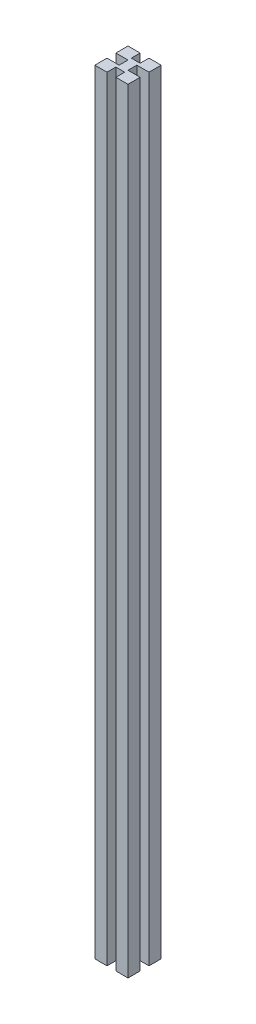
ISO-10303-21;
HEADER;
FILE_DESCRIPTION(('STEP AP214'),'2;1');
FILE_NAME('part.step','',(''),(''),'','','');
FILE_SCHEMA(('AUTOMOTIVE_DESIGN { 1 0 10303 214 1 1 1 1 }'));
ENDSEC;
DATA;
#1=APPLICATION_CONTEXT('core data for automotive mechanical design processes');
#2=APPLICATION_PROTOCOL_DEFINITION('international standard','automotive_design',2000,#1);
#3=PRODUCT_CONTEXT('',#1,'mechanical');
#4=PRODUCT('Part','Part','',(#3));
#5=PRODUCT_RELATED_PRODUCT_CATEGORY('part','',(#4));
#6=PRODUCT_DEFINITION_FORMATION('','',#4);
#7=PRODUCT_DEFINITION_CONTEXT('part definition',#1,'design');
#8=PRODUCT_DEFINITION('design','',#6,#7);
#9=PRODUCT_DEFINITION_SHAPE('','',#8);
#10=(LENGTH_UNIT() NAMED_UNIT(*) SI_UNIT(.MILLI.,.METRE.));
#11=(NAMED_UNIT(*) PLANE_ANGLE_UNIT() SI_UNIT($,.RADIAN.));
#12=(NAMED_UNIT(*) SI_UNIT($,.STERADIAN.) SOLID_ANGLE_UNIT());
#13=UNCERTAINTY_MEASURE_WITH_UNIT(LENGTH_MEASURE(1.E-05),#10,'distance_accuracy_value','');
#14=(GEOMETRIC_REPRESENTATION_CONTEXT(3) GLOBAL_UNCERTAINTY_ASSIGNED_CONTEXT((#13)) GLOBAL_UNIT_ASSIGNED_CONTEXT((#10,
#11,#12)) REPRESENTATION_CONTEXT('',''));
#15=CARTESIAN_POINT('',(0.,0.,0.));
#16=DIRECTION('',(0.,0.,1.));
#17=DIRECTION('',(1.,0.,0.));
#18=AXIS2_PLACEMENT_3D('',#15,#16,#17);
#19=CARTESIAN_POINT('',(-11.,700.,0.));
#20=DIRECTION('',(1.,0.,0.));
#21=DIRECTION('',(0.,0.,-1.));
#22=AXIS2_PLACEMENT_3D('',#19,#20,#21);
#23=PLANE('',#22);
#24=DIRECTION('',(0.,0.,1.));
#25=VECTOR('',#24,1.);
#26=CARTESIAN_POINT('',(-11.,0.,0.));
#27=LINE('',#26,#25);
#28=CARTESIAN_POINT('',(-11.,0.,-3.));
#29=VERTEX_POINT('',#28);
#30=CARTESIAN_POINT('',(-11.,0.,8.));
#31=VERTEX_POINT('',#30);
#32=EDGE_CURVE('E214',#29,#31,#27,.T.);
#33=ORIENTED_EDGE('',*,*,#32,.T.);
#34=DIRECTION('',(0.,-1.,0.));
#35=VECTOR('',#34,1.);
#36=CARTESIAN_POINT('',(-11.,700.,8.));
#37=LINE('',#36,#35);
#38=CARTESIAN_POINT('',(-11.,700.,8.));
#39=VERTEX_POINT('',#38);
#40=EDGE_CURVE('E11',#39,#31,#37,.T.);
#41=ORIENTED_EDGE('',*,*,#40,.F.);
#42=DIRECTION('',(0.,0.,1.));
#43=VECTOR('',#42,1.);
#44=CARTESIAN_POINT('',(-11.,700.,0.));
#45=LINE('',#44,#43);
#46=CARTESIAN_POINT('',(-11.,700.,-3.));
#47=VERTEX_POINT('',#46);
#48=EDGE_CURVE('E274',#47,#39,#45,.T.);
#49=ORIENTED_EDGE('',*,*,#48,.F.);
#50=DIRECTION('',(0.,-1.,0.));
#51=VECTOR('',#50,1.);
#52=CARTESIAN_POINT('',(-11.,700.,-3.));
#53=LINE('',#52,#51);
#54=EDGE_CURVE('E210',#47,#29,#53,.T.);
#55=ORIENTED_EDGE('',*,*,#54,.T.);
#56=EDGE_LOOP('',(#33,#41,#49,#55));
#57=FACE_BOUND('',#56,.T.);
#58=ADVANCED_FACE('F41',(#57),#23,.F.);
#59=CARTESIAN_POINT('',(0.,700.,8.));
#60=DIRECTION('',(0.,0.,-1.));
#61=DIRECTION('',(-1.,0.,0.));
#62=AXIS2_PLACEMENT_3D('',#59,#60,#61);
#63=PLANE('',#62);
#64=DIRECTION('',(1.,0.,0.));
#65=VECTOR('',#64,1.);
#66=CARTESIAN_POINT('',(0.,0.,8.));
#67=LINE('',#66,#65);
#68=CARTESIAN_POINT('',(0.,0.,8.));
#69=VERTEX_POINT('',#68);
#70=EDGE_CURVE('E218',#31,#69,#67,.T.);
#71=ORIENTED_EDGE('',*,*,#70,.T.);
#72=DIRECTION('',(0.,-1.,0.));
#73=VECTOR('',#72,1.);
#74=CARTESIAN_POINT('',(0.,700.,8.));
#75=LINE('',#74,#73);
#76=CARTESIAN_POINT('',(0.,700.,8.));
#77=VERTEX_POINT('',#76);
#78=EDGE_CURVE('E50',#77,#69,#75,.T.);
#79=ORIENTED_EDGE('',*,*,#78,.F.);
#80=DIRECTION('',(1.,0.,0.));
#81=VECTOR('',#80,1.);
#82=CARTESIAN_POINT('',(0.,700.,8.));
#83=LINE('',#82,#81);
#84=EDGE_CURVE('E137',#39,#77,#83,.T.);
#85=ORIENTED_EDGE('',*,*,#84,.F.);
#86=ORIENTED_EDGE('',*,*,#40,.T.);
#87=EDGE_LOOP('',(#71,#79,#85,#86));
#88=FACE_BOUND('',#87,.T.);
#89=ADVANCED_FACE('F342',(#88),#63,.F.);
#90=CARTESIAN_POINT('',(0.,700.,0.));
#91=DIRECTION('',(1.,0.,0.));
#92=DIRECTION('',(0.,0.,-1.));
#93=AXIS2_PLACEMENT_3D('',#90,#91,#92);
#94=PLANE('',#93);
#95=DIRECTION('',(0.,0.,1.));
#96=VECTOR('',#95,1.);
#97=CARTESIAN_POINT('',(0.,0.,0.));
#98=LINE('',#97,#96);
#99=CARTESIAN_POINT('',(0.,0.,0.));
#100=VERTEX_POINT('',#99);
#101=EDGE_CURVE('E222',#100,#69,#98,.T.);
#102=ORIENTED_EDGE('',*,*,#101,.F.);
#103=DIRECTION('',(0.,-1.,0.));
#104=VECTOR('',#103,1.);
#105=CARTESIAN_POINT('',(0.,700.,0.));
#106=LINE('',#105,#104);
#107=CARTESIAN_POINT('',(0.,700.,0.));
#108=VERTEX_POINT('',#107);
#109=EDGE_CURVE('E333',#108,#100,#106,.T.);
#110=ORIENTED_EDGE('',*,*,#109,.F.);
#111=DIRECTION('',(0.,0.,1.));
#112=VECTOR('',#111,1.);
#113=CARTESIAN_POINT('',(0.,700.,0.));
#114=LINE('',#113,#112);
#115=EDGE_CURVE('E341',#108,#77,#114,.T.);
#116=ORIENTED_EDGE('',*,*,#115,.T.);
#117=ORIENTED_EDGE('',*,*,#78,.T.);
#118=EDGE_LOOP('',(#102,#110,#116,#117));
#119=FACE_BOUND('',#118,.T.);
#120=ADVANCED_FACE('F339',(#119),#94,.T.);
#121=CARTESIAN_POINT('',(0.,700.,0.));
#122=DIRECTION('',(0.,0.,-1.));
#123=DIRECTION('',(-1.,0.,0.));
#124=AXIS2_PLACEMENT_3D('',#121,#122,#123);
#125=PLANE('',#124);
#126=DIRECTION('',(1.,0.,0.));
#127=VECTOR('',#126,1.);
#128=CARTESIAN_POINT('',(0.,0.,0.));
#129=LINE('',#128,#127);
#130=CARTESIAN_POINT('',(8.,0.,0.));
#131=VERTEX_POINT('',#130);
#132=EDGE_CURVE('E226',#100,#131,#129,.T.);
#133=ORIENTED_EDGE('',*,*,#132,.T.);
#134=DIRECTION('',(0.,-1.,0.));
#135=VECTOR('',#134,1.);
#136=CARTESIAN_POINT('',(8.,700.,0.));
#137=LINE('',#136,#135);
#138=CARTESIAN_POINT('',(8.,700.,0.));
#139=VERTEX_POINT('',#138);
#140=EDGE_CURVE('E329',#139,#131,#137,.T.);
#141=ORIENTED_EDGE('',*,*,#140,.F.);
#142=DIRECTION('',(1.,0.,0.));
#143=VECTOR('',#142,1.);
#144=CARTESIAN_POINT('',(0.,700.,0.));
#145=LINE('',#144,#143);
#146=EDGE_CURVE('E362',#108,#139,#145,.T.);
#147=ORIENTED_EDGE('',*,*,#146,.F.);
#148=ORIENTED_EDGE('',*,*,#109,.T.);
#149=EDGE_LOOP('',(#133,#141,#147,#148));
#150=FACE_BOUND('',#149,.T.);
#151=ADVANCED_FACE('F352',(#150),#125,.F.);
#152=CARTESIAN_POINT('',(8.,700.,0.));
#153=DIRECTION('',(1.,0.,0.));
#154=DIRECTION('',(0.,0.,-1.));
#155=AXIS2_PLACEMENT_3D('',#152,#153,#154);
#156=PLANE('',#155);
#157=DIRECTION('',(0.,0.,1.));
#158=VECTOR('',#157,1.);
#159=CARTESIAN_POINT('',(8.,0.,0.));
#160=LINE('',#159,#158);
#161=CARTESIAN_POINT('',(8.,0.,8.));
#162=VERTEX_POINT('',#161);
#163=EDGE_CURVE('E229',#131,#162,#160,.T.);
#164=ORIENTED_EDGE('',*,*,#163,.T.);
#165=DIRECTION('',(0.,-1.,0.));
#166=VECTOR('',#165,1.);
#167=CARTESIAN_POINT('',(8.,700.,8.));
#168=LINE('',#167,#166);
#169=CARTESIAN_POINT('',(8.,700.,8.));
#170=VERTEX_POINT('',#169);
#171=EDGE_CURVE('E325',#170,#162,#168,.T.);
#172=ORIENTED_EDGE('',*,*,#171,.F.);
#173=DIRECTION('',(0.,0.,1.));
#174=VECTOR('',#173,1.);
#175=CARTESIAN_POINT('',(8.,700.,0.));
#176=LINE('',#175,#174);
#177=EDGE_CURVE('E358',#139,#170,#176,.T.);
#178=ORIENTED_EDGE('',*,*,#177,.F.);
#179=ORIENTED_EDGE('',*,*,#140,.T.);
#180=EDGE_LOOP('',(#164,#172,#178,#179));
#181=FACE_BOUND('',#180,.T.);
#182=ADVANCED_FACE('F356',(#181),#156,.F.);
#183=CARTESIAN_POINT('',(0.,700.,8.));
#184=DIRECTION('',(0.,0.,-1.));
#185=DIRECTION('',(-1.,0.,0.));
#186=AXIS2_PLACEMENT_3D('',#183,#184,#185);
#187=PLANE('',#186);
#188=DIRECTION('',(1.,0.,0.));
#189=VECTOR('',#188,1.);
#190=CARTESIAN_POINT('',(0.,0.,8.));
#191=LINE('',#190,#189);
#192=CARTESIAN_POINT('',(19.,0.,8.));
#193=VERTEX_POINT('',#192);
#194=EDGE_CURVE('E232',#162,#193,#191,.T.);
#195=ORIENTED_EDGE('',*,*,#194,.T.);
#196=DIRECTION('',(0.,-1.,0.));
#197=VECTOR('',#196,1.);
#198=CARTESIAN_POINT('',(19.,700.,8.));
#199=LINE('',#198,#197);
#200=CARTESIAN_POINT('',(19.,700.,8.));
#201=VERTEX_POINT('',#200);
#202=EDGE_CURVE('E321',#201,#193,#199,.T.);
#203=ORIENTED_EDGE('',*,*,#202,.F.);
#204=DIRECTION('',(1.,0.,0.));
#205=VECTOR('',#204,1.);
#206=CARTESIAN_POINT('',(0.,700.,8.));
#207=LINE('',#206,#205);
#208=EDGE_CURVE('E361',#170,#201,#207,.T.);
#209=ORIENTED_EDGE('',*,*,#208,.F.);
#210=ORIENTED_EDGE('',*,*,#171,.T.);
#211=EDGE_LOOP('',(#195,#203,#209,#210));
#212=FACE_BOUND('',#211,.T.);
#213=ADVANCED_FACE('F435',(#212),#187,.F.);
#214=CARTESIAN_POINT('',(19.,700.,0.));
#215=DIRECTION('',(-1.,0.,0.));
#216=DIRECTION('',(0.,0.,1.));
#217=AXIS2_PLACEMENT_3D('',#214,#215,#216);
#218=PLANE('',#217);
#219=DIRECTION('',(0.,0.,-1.));
#220=VECTOR('',#219,1.);
#221=CARTESIAN_POINT('',(19.,0.,0.));
#222=LINE('',#221,#220);
#223=CARTESIAN_POINT('',(19.,0.,-3.));
#224=VERTEX_POINT('',#223);
#225=EDGE_CURVE('E235',#193,#224,#222,.T.);
#226=ORIENTED_EDGE('',*,*,#225,.T.);
#227=DIRECTION('',(0.,-1.,0.));
#228=VECTOR('',#227,1.);
#229=CARTESIAN_POINT('',(19.,700.,-3.));
#230=LINE('',#229,#228);
#231=CARTESIAN_POINT('',(19.,700.,-3.));
#232=VERTEX_POINT('',#231);
#233=EDGE_CURVE('E317',#232,#224,#230,.T.);
#234=ORIENTED_EDGE('',*,*,#233,.F.);
#235=DIRECTION('',(0.,0.,-1.));
#236=VECTOR('',#235,1.);
#237=CARTESIAN_POINT('',(19.,700.,0.));
#238=LINE('',#237,#236);
#239=EDGE_CURVE('E366',#201,#232,#238,.T.);
#240=ORIENTED_EDGE('',*,*,#239,.F.);
#241=ORIENTED_EDGE('',*,*,#202,.T.);
#242=EDGE_LOOP('',(#226,#234,#240,#241));
#243=FACE_BOUND('',#242,.T.);
#244=ADVANCED_FACE('F438',(#243),#218,.F.);
#245=CARTESIAN_POINT('',(0.,700.,-3.));
#246=DIRECTION('',(0.,0.,1.));
#247=DIRECTION('',(1.,0.,0.));
#248=AXIS2_PLACEMENT_3D('',#245,#246,#247);
#249=PLANE('',#248);
#250=DIRECTION('',(-1.,0.,0.));
#251=VECTOR('',#250,1.);
#252=CARTESIAN_POINT('',(0.,0.,-3.));
#253=LINE('',#252,#251);
#254=CARTESIAN_POINT('',(8.,0.,-3.));
#255=VERTEX_POINT('',#254);
#256=EDGE_CURVE('E238',#224,#255,#253,.T.);
#257=ORIENTED_EDGE('',*,*,#256,.T.);
#258=DIRECTION('',(0.,-1.,0.));
#259=VECTOR('',#258,1.);
#260=CARTESIAN_POINT('',(8.,700.,-3.));
#261=LINE('',#260,#259);
#262=CARTESIAN_POINT('',(8.,700.,-3.));
#263=VERTEX_POINT('',#262);
#264=EDGE_CURVE('E313',#263,#255,#261,.T.);
#265=ORIENTED_EDGE('',*,*,#264,.F.);
#266=DIRECTION('',(-1.,0.,0.));
#267=VECTOR('',#266,1.);
#268=CARTESIAN_POINT('',(0.,700.,-3.));
#269=LINE('',#268,#267);
#270=EDGE_CURVE('E373',#232,#263,#269,.T.);
#271=ORIENTED_EDGE('',*,*,#270,.F.);
#272=ORIENTED_EDGE('',*,*,#233,.T.);
#273=EDGE_LOOP('',(#257,#265,#271,#272));
#274=FACE_BOUND('',#273,.T.);
#275=ADVANCED_FACE('F442',(#274),#249,.F.);
#276=CARTESIAN_POINT('',(8.,700.,0.));
#277=DIRECTION('',(-1.,0.,0.));
#278=DIRECTION('',(0.,0.,1.));
#279=AXIS2_PLACEMENT_3D('',#276,#277,#278);
#280=PLANE('',#279);
#281=DIRECTION('',(0.,0.,-1.));
#282=VECTOR('',#281,1.);
#283=CARTESIAN_POINT('',(8.,0.,0.));
#284=LINE('',#283,#282);
#285=CARTESIAN_POINT('',(8.,0.,-11.));
#286=VERTEX_POINT('',#285);
#287=EDGE_CURVE('E241',#255,#286,#284,.T.);
#288=ORIENTED_EDGE('',*,*,#287,.T.);
#289=DIRECTION('',(0.,-1.,0.));
#290=VECTOR('',#289,1.);
#291=CARTESIAN_POINT('',(8.,700.,-11.));
#292=LINE('',#291,#290);
#293=CARTESIAN_POINT('',(8.,700.,-11.));
#294=VERTEX_POINT('',#293);
#295=EDGE_CURVE('E309',#294,#286,#292,.T.);
#296=ORIENTED_EDGE('',*,*,#295,.F.);
#297=DIRECTION('',(0.,0.,-1.));
#298=VECTOR('',#297,1.);
#299=CARTESIAN_POINT('',(8.,700.,0.));
#300=LINE('',#299,#298);
#301=EDGE_CURVE('E376',#263,#294,#300,.T.);
#302=ORIENTED_EDGE('',*,*,#301,.F.);
#303=ORIENTED_EDGE('',*,*,#264,.T.);
#304=EDGE_LOOP('',(#288,#296,#302,#303));
#305=FACE_BOUND('',#304,.T.);
#306=ADVANCED_FACE('F446',(#305),#280,.F.);
#307=CARTESIAN_POINT('',(0.,700.,-11.));
#308=DIRECTION('',(0.,0.,-1.));
#309=DIRECTION('',(-1.,0.,0.));
#310=AXIS2_PLACEMENT_3D('',#307,#308,#309);
#311=PLANE('',#310);
#312=DIRECTION('',(1.,0.,0.));
#313=VECTOR('',#312,1.);
#314=CARTESIAN_POINT('',(0.,0.,-11.));
#315=LINE('',#314,#313);
#316=CARTESIAN_POINT('',(19.,0.,-11.));
#317=VERTEX_POINT('',#316);
#318=EDGE_CURVE('E244',#286,#317,#315,.T.);
#319=ORIENTED_EDGE('',*,*,#318,.T.);
#320=DIRECTION('',(0.,-1.,0.));
#321=VECTOR('',#320,1.);
#322=CARTESIAN_POINT('',(19.,700.,-11.));
#323=LINE('',#322,#321);
#324=CARTESIAN_POINT('',(19.,700.,-11.));
#325=VERTEX_POINT('',#324);
#326=EDGE_CURVE('E305',#325,#317,#323,.T.);
#327=ORIENTED_EDGE('',*,*,#326,.F.);
#328=DIRECTION('',(1.,0.,0.));
#329=VECTOR('',#328,1.);
#330=CARTESIAN_POINT('',(0.,700.,-11.));
#331=LINE('',#330,#329);
#332=EDGE_CURVE('E379',#294,#325,#331,.T.);
#333=ORIENTED_EDGE('',*,*,#332,.F.);
#334=ORIENTED_EDGE('',*,*,#295,.T.);
#335=EDGE_LOOP('',(#319,#327,#333,#334));
#336=FACE_BOUND('',#335,.T.);
#337=ADVANCED_FACE('F450',(#336),#311,.F.);
#338=CARTESIAN_POINT('',(19.,700.,0.));
#339=DIRECTION('',(-1.,0.,0.));
#340=DIRECTION('',(0.,0.,1.));
#341=AXIS2_PLACEMENT_3D('',#338,#339,#340);
#342=PLANE('',#341);
#343=DIRECTION('',(0.,0.,-1.));
#344=VECTOR('',#343,1.);
#345=CARTESIAN_POINT('',(19.,0.,0.));
#346=LINE('',#345,#344);
#347=CARTESIAN_POINT('',(19.,0.,-22.));
#348=VERTEX_POINT('',#347);
#349=EDGE_CURVE('E247',#317,#348,#346,.T.);
#350=ORIENTED_EDGE('',*,*,#349,.T.);
#351=DIRECTION('',(0.,-1.,0.));
#352=VECTOR('',#351,1.);
#353=CARTESIAN_POINT('',(19.,700.,-22.));
#354=LINE('',#353,#352);
#355=CARTESIAN_POINT('',(19.,700.,-22.));
#356=VERTEX_POINT('',#355);
#357=EDGE_CURVE('E301',#356,#348,#354,.T.);
#358=ORIENTED_EDGE('',*,*,#357,.F.);
#359=DIRECTION('',(0.,0.,-1.));
#360=VECTOR('',#359,1.);
#361=CARTESIAN_POINT('',(19.,700.,0.));
#362=LINE('',#361,#360);
#363=EDGE_CURVE('E382',#325,#356,#362,.T.);
#364=ORIENTED_EDGE('',*,*,#363,.F.);
#365=ORIENTED_EDGE('',*,*,#326,.T.);
#366=EDGE_LOOP('',(#350,#358,#364,#365));
#367=FACE_BOUND('',#366,.T.);
#368=ADVANCED_FACE('F454',(#367),#342,.F.);
#369=CARTESIAN_POINT('',(0.,700.,-22.));
#370=DIRECTION('',(0.,0.,1.));
#371=DIRECTION('',(1.,0.,0.));
#372=AXIS2_PLACEMENT_3D('',#369,#370,#371);
#373=PLANE('',#372);
#374=DIRECTION('',(-1.,0.,0.));
#375=VECTOR('',#374,1.);
#376=CARTESIAN_POINT('',(0.,0.,-22.));
#377=LINE('',#376,#375);
#378=CARTESIAN_POINT('',(8.,0.,-22.));
#379=VERTEX_POINT('',#378);
#380=EDGE_CURVE('E250',#348,#379,#377,.T.);
#381=ORIENTED_EDGE('',*,*,#380,.T.);
#382=DIRECTION('',(0.,-1.,0.));
#383=VECTOR('',#382,1.);
#384=CARTESIAN_POINT('',(8.,700.,-22.));
#385=LINE('',#384,#383);
#386=CARTESIAN_POINT('',(8.,700.,-22.));
#387=VERTEX_POINT('',#386);
#388=EDGE_CURVE('E297',#387,#379,#385,.T.);
#389=ORIENTED_EDGE('',*,*,#388,.F.);
#390=DIRECTION('',(-1.,0.,0.));
#391=VECTOR('',#390,1.);
#392=CARTESIAN_POINT('',(0.,700.,-22.));
#393=LINE('',#392,#391);
#394=EDGE_CURVE('E385',#356,#387,#393,.T.);
#395=ORIENTED_EDGE('',*,*,#394,.F.);
#396=ORIENTED_EDGE('',*,*,#357,.T.);
#397=EDGE_LOOP('',(#381,#389,#395,#396));
#398=FACE_BOUND('',#397,.T.);
#399=ADVANCED_FACE('F458',(#398),#373,.F.);
#400=CARTESIAN_POINT('',(8.,700.,0.));
#401=DIRECTION('',(1.,0.,0.));
#402=DIRECTION('',(0.,0.,-1.));
#403=AXIS2_PLACEMENT_3D('',#400,#401,#402);
#404=PLANE('',#403);
#405=DIRECTION('',(0.,0.,1.));
#406=VECTOR('',#405,1.);
#407=CARTESIAN_POINT('',(8.,0.,0.));
#408=LINE('',#407,#406);
#409=CARTESIAN_POINT('',(8.,0.,-14.));
#410=VERTEX_POINT('',#409);
#411=EDGE_CURVE('E253',#379,#410,#408,.T.);
#412=ORIENTED_EDGE('',*,*,#411,.T.);
#413=DIRECTION('',(0.,-1.,0.));
#414=VECTOR('',#413,1.);
#415=CARTESIAN_POINT('',(8.,700.,-14.));
#416=LINE('',#415,#414);
#417=CARTESIAN_POINT('',(8.,700.,-14.));
#418=VERTEX_POINT('',#417);
#419=EDGE_CURVE('E293',#418,#410,#416,.T.);
#420=ORIENTED_EDGE('',*,*,#419,.F.);
#421=DIRECTION('',(0.,0.,1.));
#422=VECTOR('',#421,1.);
#423=CARTESIAN_POINT('',(8.,700.,0.));
#424=LINE('',#423,#422);
#425=EDGE_CURVE('E388',#387,#418,#424,.T.);
#426=ORIENTED_EDGE('',*,*,#425,.F.);
#427=ORIENTED_EDGE('',*,*,#388,.T.);
#428=EDGE_LOOP('',(#412,#420,#426,#427));
#429=FACE_BOUND('',#428,.T.);
#430=ADVANCED_FACE('F462',(#429),#404,.F.);
#431=CARTESIAN_POINT('',(0.,700.,-14.));
#432=DIRECTION('',(0.,0.,1.));
#433=DIRECTION('',(1.,0.,0.));
#434=AXIS2_PLACEMENT_3D('',#431,#432,#433);
#435=PLANE('',#434);
#436=DIRECTION('',(-1.,0.,0.));
#437=VECTOR('',#436,1.);
#438=CARTESIAN_POINT('',(0.,0.,-14.));
#439=LINE('',#438,#437);
#440=CARTESIAN_POINT('',(0.,0.,-14.));
#441=VERTEX_POINT('',#440);
#442=EDGE_CURVE('E256',#410,#441,#439,.T.);
#443=ORIENTED_EDGE('',*,*,#442,.T.);
#444=DIRECTION('',(0.,-1.,0.));
#445=VECTOR('',#444,1.);
#446=CARTESIAN_POINT('',(0.,700.,-14.));
#447=LINE('',#446,#445);
#448=CARTESIAN_POINT('',(0.,700.,-14.));
#449=VERTEX_POINT('',#448);
#450=EDGE_CURVE('E289',#449,#441,#447,.T.);
#451=ORIENTED_EDGE('',*,*,#450,.F.);
#452=DIRECTION('',(-1.,0.,0.));
#453=VECTOR('',#452,1.);
#454=CARTESIAN_POINT('',(0.,700.,-14.));
#455=LINE('',#454,#453);
#456=EDGE_CURVE('E391',#418,#449,#455,.T.);
#457=ORIENTED_EDGE('',*,*,#456,.F.);
#458=ORIENTED_EDGE('',*,*,#419,.T.);
#459=EDGE_LOOP('',(#443,#451,#457,#458));
#460=FACE_BOUND('',#459,.T.);
#461=ADVANCED_FACE('F466',(#460),#435,.F.);
#462=CARTESIAN_POINT('',(0.,700.,0.));
#463=DIRECTION('',(-1.,0.,0.));
#464=DIRECTION('',(0.,0.,1.));
#465=AXIS2_PLACEMENT_3D('',#462,#463,#464);
#466=PLANE('',#465);
#467=DIRECTION('',(0.,0.,-1.));
#468=VECTOR('',#467,1.);
#469=CARTESIAN_POINT('',(0.,0.,0.));
#470=LINE('',#469,#468);
#471=CARTESIAN_POINT('',(0.,0.,-22.));
#472=VERTEX_POINT('',#471);
#473=EDGE_CURVE('E259',#441,#472,#470,.T.);
#474=ORIENTED_EDGE('',*,*,#473,.T.);
#475=DIRECTION('',(0.,-1.,0.));
#476=VECTOR('',#475,1.);
#477=CARTESIAN_POINT('',(0.,700.,-22.));
#478=LINE('',#477,#476);
#479=CARTESIAN_POINT('',(0.,700.,-22.));
#480=VERTEX_POINT('',#479);
#481=EDGE_CURVE('E285',#480,#472,#478,.T.);
#482=ORIENTED_EDGE('',*,*,#481,.F.);
#483=DIRECTION('',(0.,0.,-1.));
#484=VECTOR('',#483,1.);
#485=CARTESIAN_POINT('',(0.,700.,0.));
#486=LINE('',#485,#484);
#487=EDGE_CURVE('E394',#449,#480,#486,.T.);
#488=ORIENTED_EDGE('',*,*,#487,.F.);
#489=ORIENTED_EDGE('',*,*,#450,.T.);
#490=EDGE_LOOP('',(#474,#482,#488,#489));
#491=FACE_BOUND('',#490,.T.);
#492=ADVANCED_FACE('F470',(#491),#466,.F.);
#493=CARTESIAN_POINT('',(0.,700.,-22.));
#494=DIRECTION('',(0.,0.,1.));
#495=DIRECTION('',(1.,0.,0.));
#496=AXIS2_PLACEMENT_3D('',#493,#494,#495);
#497=PLANE('',#496);
#498=DIRECTION('',(-1.,0.,0.));
#499=VECTOR('',#498,1.);
#500=CARTESIAN_POINT('',(0.,0.,-22.));
#501=LINE('',#500,#499);
#502=CARTESIAN_POINT('',(-11.,0.,-22.));
#503=VERTEX_POINT('',#502);
#504=EDGE_CURVE('E262',#472,#503,#501,.T.);
#505=ORIENTED_EDGE('',*,*,#504,.T.);
#506=DIRECTION('',(0.,-1.,0.));
#507=VECTOR('',#506,1.);
#508=CARTESIAN_POINT('',(-11.,700.,-22.));
#509=LINE('',#508,#507);
#510=CARTESIAN_POINT('',(-11.,700.,-22.));
#511=VERTEX_POINT('',#510);
#512=EDGE_CURVE('E281',#511,#503,#509,.T.);
#513=ORIENTED_EDGE('',*,*,#512,.F.);
#514=DIRECTION('',(-1.,0.,0.));
#515=VECTOR('',#514,1.);
#516=CARTESIAN_POINT('',(0.,700.,-22.));
#517=LINE('',#516,#515);
#518=EDGE_CURVE('E397',#480,#511,#517,.T.);
#519=ORIENTED_EDGE('',*,*,#518,.F.);
#520=ORIENTED_EDGE('',*,*,#481,.T.);
#521=EDGE_LOOP('',(#505,#513,#519,#520));
#522=FACE_BOUND('',#521,.T.);
#523=ADVANCED_FACE('F405',(#522),#497,.F.);
#524=CARTESIAN_POINT('',(-11.,700.,0.));
#525=DIRECTION('',(1.,0.,0.));
#526=DIRECTION('',(0.,0.,-1.));
#527=AXIS2_PLACEMENT_3D('',#524,#525,#526);
#528=PLANE('',#527);
#529=DIRECTION('',(0.,0.,1.));
#530=VECTOR('',#529,1.);
#531=CARTESIAN_POINT('',(-11.,0.,0.));
#532=LINE('',#531,#530);
#533=CARTESIAN_POINT('',(-11.,0.,-11.));
#534=VERTEX_POINT('',#533);
#535=EDGE_CURVE('E265',#503,#534,#532,.T.);
#536=ORIENTED_EDGE('',*,*,#535,.T.);
#537=DIRECTION('',(0.,-1.,0.));
#538=VECTOR('',#537,1.);
#539=CARTESIAN_POINT('',(-11.,700.,-11.));
#540=LINE('',#539,#538);
#541=CARTESIAN_POINT('',(-11.,700.,-11.));
#542=VERTEX_POINT('',#541);
#543=EDGE_CURVE('E203',#542,#534,#540,.T.);
#544=ORIENTED_EDGE('',*,*,#543,.F.);
#545=DIRECTION('',(0.,0.,1.));
#546=VECTOR('',#545,1.);
#547=CARTESIAN_POINT('',(-11.,700.,0.));
#548=LINE('',#547,#546);
#549=EDGE_CURVE('E192',#511,#542,#548,.T.);
#550=ORIENTED_EDGE('',*,*,#549,.F.);
#551=ORIENTED_EDGE('',*,*,#512,.T.);
#552=EDGE_LOOP('',(#536,#544,#550,#551));
#553=FACE_BOUND('',#552,.T.);
#554=ADVANCED_FACE('F409',(#553),#528,.F.);
#555=CARTESIAN_POINT('',(0.,700.,-11.));
#556=DIRECTION('',(0.,0.,-1.));
#557=DIRECTION('',(-1.,0.,0.));
#558=AXIS2_PLACEMENT_3D('',#555,#556,#557);
#559=PLANE('',#558);
#560=DIRECTION('',(1.,0.,0.));
#561=VECTOR('',#560,1.);
#562=CARTESIAN_POINT('',(0.,0.,-11.));
#563=LINE('',#562,#561);
#564=CARTESIAN_POINT('',(0.,0.,-11.));
#565=VERTEX_POINT('',#564);
#566=EDGE_CURVE('E201',#534,#565,#563,.T.);
#567=ORIENTED_EDGE('',*,*,#566,.T.);
#568=DIRECTION('',(0.,-1.,0.));
#569=VECTOR('',#568,1.);
#570=CARTESIAN_POINT('',(0.,700.,-11.));
#571=LINE('',#570,#569);
#572=CARTESIAN_POINT('',(0.,700.,-11.));
#573=VERTEX_POINT('',#572);
#574=EDGE_CURVE('E198',#573,#565,#571,.T.);
#575=ORIENTED_EDGE('',*,*,#574,.F.);
#576=DIRECTION('',(1.,0.,0.));
#577=VECTOR('',#576,1.);
#578=CARTESIAN_POINT('',(0.,700.,-11.));
#579=LINE('',#578,#577);
#580=EDGE_CURVE('E186',#542,#573,#579,.T.);
#581=ORIENTED_EDGE('',*,*,#580,.F.);
#582=ORIENTED_EDGE('',*,*,#543,.T.);
#583=EDGE_LOOP('',(#567,#575,#581,#582));
#584=FACE_BOUND('',#583,.T.);
#585=ADVANCED_FACE('F199',(#584),#559,.F.);
#586=CARTESIAN_POINT('',(0.,700.,0.));
#587=DIRECTION('',(1.,0.,0.));
#588=DIRECTION('',(0.,0.,-1.));
#589=AXIS2_PLACEMENT_3D('',#586,#587,#588);
#590=PLANE('',#589);
#591=DIRECTION('',(0.,0.,1.));
#592=VECTOR('',#591,1.);
#593=CARTESIAN_POINT('',(0.,0.,0.));
#594=LINE('',#593,#592);
#595=CARTESIAN_POINT('',(0.,0.,-3.));
#596=VERTEX_POINT('',#595);
#597=EDGE_CURVE('E123',#565,#596,#594,.T.);
#598=ORIENTED_EDGE('',*,*,#597,.T.);
#599=DIRECTION('',(0.,-1.,0.));
#600=VECTOR('',#599,1.);
#601=CARTESIAN_POINT('',(0.,700.,-3.));
#602=LINE('',#601,#600);
#603=CARTESIAN_POINT('',(0.,700.,-3.));
#604=VERTEX_POINT('',#603);
#605=EDGE_CURVE('E204',#604,#596,#602,.T.);
#606=ORIENTED_EDGE('',*,*,#605,.F.);
#607=DIRECTION('',(0.,0.,1.));
#608=VECTOR('',#607,1.);
#609=CARTESIAN_POINT('',(0.,700.,0.));
#610=LINE('',#609,#608);
#611=EDGE_CURVE('E190',#573,#604,#610,.T.);
#612=ORIENTED_EDGE('',*,*,#611,.F.);
#613=ORIENTED_EDGE('',*,*,#574,.T.);
#614=EDGE_LOOP('',(#598,#606,#612,#613));
#615=FACE_BOUND('',#614,.T.);
#616=ADVANCED_FACE('F206',(#615),#590,.F.);
#617=CARTESIAN_POINT('',(0.,700.,-3.));
#618=DIRECTION('',(0.,0.,1.));
#619=DIRECTION('',(1.,0.,0.));
#620=AXIS2_PLACEMENT_3D('',#617,#618,#619);
#621=PLANE('',#620);
#622=DIRECTION('',(-1.,0.,0.));
#623=VECTOR('',#622,1.);
#624=CARTESIAN_POINT('',(0.,0.,-3.));
#625=LINE('',#624,#623);
#626=EDGE_CURVE('E129',#596,#29,#625,.T.);
#627=ORIENTED_EDGE('',*,*,#626,.T.);
#628=ORIENTED_EDGE('',*,*,#54,.F.);
#629=DIRECTION('',(-1.,0.,0.));
#630=VECTOR('',#629,1.);
#631=CARTESIAN_POINT('',(0.,700.,-3.));
#632=LINE('',#631,#630);
#633=EDGE_CURVE('E58',#604,#47,#632,.T.);
#634=ORIENTED_EDGE('',*,*,#633,.F.);
#635=ORIENTED_EDGE('',*,*,#605,.T.);
#636=EDGE_LOOP('',(#627,#628,#634,#635));
#637=FACE_BOUND('',#636,.T.);
#638=ADVANCED_FACE('F412',(#637),#621,.F.);
#639=CARTESIAN_POINT('',(0.,700.,0.));
#640=DIRECTION('',(0.,1.,0.));
#641=DIRECTION('',(0.,0.,1.));
#642=AXIS2_PLACEMENT_3D('',#639,#640,#641);
#643=PLANE('',#642);
#644=ORIENTED_EDGE('',*,*,#48,.T.);
#645=ORIENTED_EDGE('',*,*,#84,.T.);
#646=ORIENTED_EDGE('',*,*,#115,.F.);
#647=ORIENTED_EDGE('',*,*,#146,.T.);
#648=ORIENTED_EDGE('',*,*,#177,.T.);
#649=ORIENTED_EDGE('',*,*,#208,.T.);
#650=ORIENTED_EDGE('',*,*,#239,.T.);
#651=ORIENTED_EDGE('',*,*,#270,.T.);
#652=ORIENTED_EDGE('',*,*,#301,.T.);
#653=ORIENTED_EDGE('',*,*,#332,.T.);
#654=ORIENTED_EDGE('',*,*,#363,.T.);
#655=ORIENTED_EDGE('',*,*,#394,.T.);
#656=ORIENTED_EDGE('',*,*,#425,.T.);
#657=ORIENTED_EDGE('',*,*,#456,.T.);
#658=ORIENTED_EDGE('',*,*,#487,.T.);
#659=ORIENTED_EDGE('',*,*,#518,.T.);
#660=ORIENTED_EDGE('',*,*,#549,.T.);
#661=ORIENTED_EDGE('',*,*,#580,.T.);
#662=ORIENTED_EDGE('',*,*,#611,.T.);
#663=ORIENTED_EDGE('',*,*,#633,.T.);
#664=EDGE_LOOP('',(#644,#645,#646,#647,#648,#649,#650,#651,#652,#653,#654,#655,#656,#657,#658,
#659,#660,#661,#662,#663));
#665=FACE_BOUND('',#664,.T.);
#666=ADVANCED_FACE('F188',(#665),#643,.T.);
#667=CARTESIAN_POINT('',(0.,0.,0.));
#668=DIRECTION('',(0.,1.,0.));
#669=DIRECTION('',(0.,0.,1.));
#670=AXIS2_PLACEMENT_3D('',#667,#668,#669);
#671=PLANE('',#670);
#672=ORIENTED_EDGE('',*,*,#32,.F.);
#673=ORIENTED_EDGE('',*,*,#626,.F.);
#674=ORIENTED_EDGE('',*,*,#597,.F.);
#675=ORIENTED_EDGE('',*,*,#566,.F.);
#676=ORIENTED_EDGE('',*,*,#535,.F.);
#677=ORIENTED_EDGE('',*,*,#504,.F.);
#678=ORIENTED_EDGE('',*,*,#473,.F.);
#679=ORIENTED_EDGE('',*,*,#442,.F.);
#680=ORIENTED_EDGE('',*,*,#411,.F.);
#681=ORIENTED_EDGE('',*,*,#380,.F.);
#682=ORIENTED_EDGE('',*,*,#349,.F.);
#683=ORIENTED_EDGE('',*,*,#318,.F.);
#684=ORIENTED_EDGE('',*,*,#287,.F.);
#685=ORIENTED_EDGE('',*,*,#256,.F.);
#686=ORIENTED_EDGE('',*,*,#225,.F.);
#687=ORIENTED_EDGE('',*,*,#194,.F.);
#688=ORIENTED_EDGE('',*,*,#163,.F.);
#689=ORIENTED_EDGE('',*,*,#132,.F.);
#690=ORIENTED_EDGE('',*,*,#101,.T.);
#691=ORIENTED_EDGE('',*,*,#70,.F.);
#692=EDGE_LOOP('',(#672,#673,#674,#675,#676,#677,#678,#679,#680,#681,#682,#683,#684,#685,#686,
#687,#688,#689,#690,#691));
#693=FACE_BOUND('',#692,.T.);
#694=ADVANCED_FACE('F347',(#693),#671,.F.);
#695=CLOSED_SHELL('',(#58,#89,#120,#151,#182,#213,#244,#275,#306,#337,#368,#399,#430,#461,#492,
#523,#554,#585,#616,#638,#666,#694));
#696=MANIFOLD_SOLID_BREP('B2',#695);
#697=ADVANCED_BREP_SHAPE_REPRESENTATION('',(#18,#696),#14);
#698=SHAPE_DEFINITION_REPRESENTATION(#9,#697);
ENDSEC;
END-ISO-10303-21;
